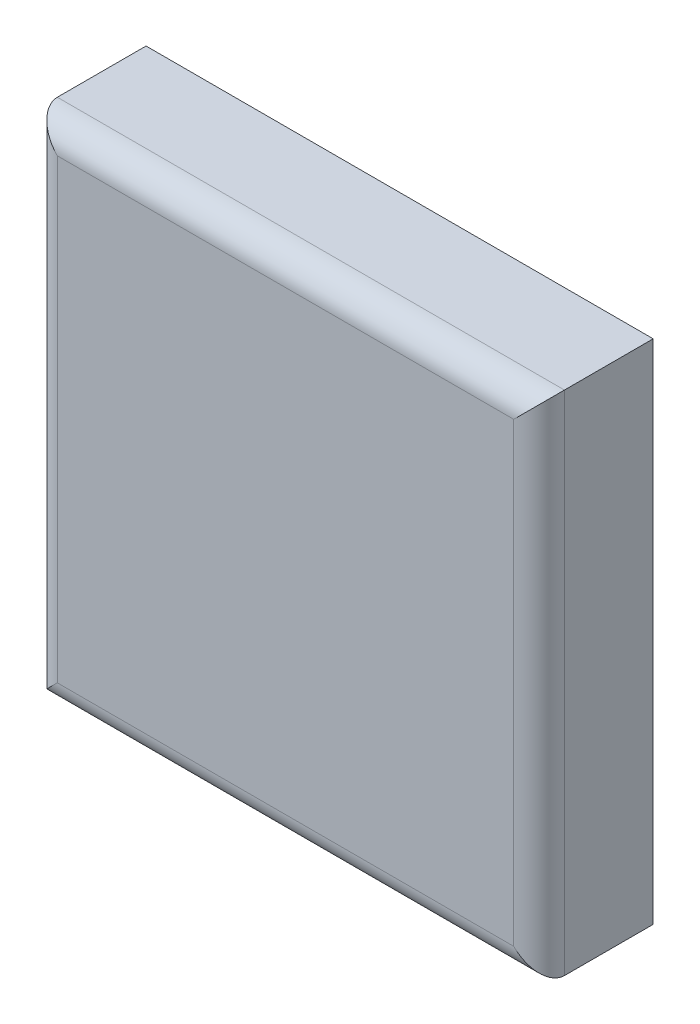
ISO-10303-21;
HEADER;
FILE_DESCRIPTION(('STEP AP214'),'2;1');
FILE_NAME('part.step','',(''),(''),'','','');
FILE_SCHEMA(('AUTOMOTIVE_DESIGN { 1 0 10303 214 1 1 1 1 }'));
ENDSEC;
DATA;
#1=APPLICATION_CONTEXT('core data for automotive mechanical design processes');
#2=APPLICATION_PROTOCOL_DEFINITION('international standard','automotive_design',2000,#1);
#3=PRODUCT_CONTEXT('',#1,'mechanical');
#4=PRODUCT('Part','Part','',(#3));
#5=PRODUCT_RELATED_PRODUCT_CATEGORY('part','',(#4));
#6=PRODUCT_DEFINITION_FORMATION('','',#4);
#7=PRODUCT_DEFINITION_CONTEXT('part definition',#1,'design');
#8=PRODUCT_DEFINITION('design','',#6,#7);
#9=PRODUCT_DEFINITION_SHAPE('','',#8);
#10=(LENGTH_UNIT() NAMED_UNIT(*) SI_UNIT(.MILLI.,.METRE.));
#11=(NAMED_UNIT(*) PLANE_ANGLE_UNIT() SI_UNIT($,.RADIAN.));
#12=(NAMED_UNIT(*) SI_UNIT($,.STERADIAN.) SOLID_ANGLE_UNIT());
#13=UNCERTAINTY_MEASURE_WITH_UNIT(LENGTH_MEASURE(1.E-05),#10,'distance_accuracy_value','');
#14=(GEOMETRIC_REPRESENTATION_CONTEXT(3) GLOBAL_UNCERTAINTY_ASSIGNED_CONTEXT((#13)) GLOBAL_UNIT_ASSIGNED_CONTEXT((#10,
#11,#12)) REPRESENTATION_CONTEXT('',''));
#15=CARTESIAN_POINT('',(0.,0.,0.));
#16=DIRECTION('',(0.,0.,1.));
#17=DIRECTION('',(1.,0.,0.));
#18=AXIS2_PLACEMENT_3D('',#15,#16,#17);
#19=CARTESIAN_POINT('',(100.,808.165252795848,-828.906828675602));
#20=DIRECTION('',(0.,-1.,0.));
#21=DIRECTION('',(0.,0.,-1.));
#22=AXIS2_PLACEMENT_3D('',#19,#20,#21);
#23=PLANE('',#22);
#24=DIRECTION('',(0.,0.,1.));
#25=VECTOR('',#24,1.);
#26=CARTESIAN_POINT('',(-100.,808.165252795848,-828.906828675602));
#27=LINE('',#26,#25);
#28=CARTESIAN_POINT('',(-100.,808.165252795848,-873.906828675602));
#29=VERTEX_POINT('',#28);
#30=CARTESIAN_POINT('',(-100.,808.165252795848,-838.906828675602));
#31=VERTEX_POINT('',#30);
#32=EDGE_CURVE('E116',#29,#31,#27,.T.);
#33=ORIENTED_EDGE('',*,*,#32,.T.);
#34=DIRECTION('',(-1.,0.,0.));
#35=VECTOR('',#34,1.);
#36=CARTESIAN_POINT('',(100.,808.165252795848,-838.906828675602));
#37=LINE('',#36,#35);
#38=CARTESIAN_POINT('',(100.,808.165252795848,-838.906828675602));
#39=VERTEX_POINT('',#38);
#40=EDGE_CURVE('E130',#31,#39,#37,.F.);
#41=ORIENTED_EDGE('',*,*,#40,.T.);
#42=DIRECTION('',(0.,0.,1.));
#43=VECTOR('',#42,1.);
#44=CARTESIAN_POINT('',(100.,808.165252795848,-828.906828675602));
#45=LINE('',#44,#43);
#46=CARTESIAN_POINT('',(100.,808.165252795848,-873.906828675602));
#47=VERTEX_POINT('',#46);
#48=EDGE_CURVE('E98',#47,#39,#45,.T.);
#49=ORIENTED_EDGE('',*,*,#48,.F.);
#50=DIRECTION('',(-1.,0.,0.));
#51=VECTOR('',#50,1.);
#52=CARTESIAN_POINT('',(100.,808.165252795848,-873.906828675602));
#53=LINE('',#52,#51);
#54=EDGE_CURVE('E107',#47,#29,#53,.T.);
#55=ORIENTED_EDGE('',*,*,#54,.T.);
#56=EDGE_LOOP('',(#33,#41,#49,#55));
#57=FACE_BOUND('',#56,.T.);
#58=ADVANCED_FACE('F41',(#57),#23,.F.);
#59=CARTESIAN_POINT('',(100.,808.165252795848,-828.906828675602));
#60=DIRECTION('',(0.,0.,-1.));
#61=DIRECTION('',(0.,1.,0.));
#62=AXIS2_PLACEMENT_3D('',#59,#60,#61);
#63=PLANE('',#62);
#64=DIRECTION('',(0.,-1.,0.));
#65=VECTOR('',#64,1.);
#66=CARTESIAN_POINT('',(90.,808.165252795848,-828.906828675602));
#67=LINE('',#66,#65);
#68=CARTESIAN_POINT('',(90.,618.165252795849,-828.906828675596));
#69=VERTEX_POINT('',#68);
#70=CARTESIAN_POINT('',(90.,798.165252795848,-828.906828675602));
#71=VERTEX_POINT('',#70);
#72=EDGE_CURVE('E125',#69,#71,#67,.F.);
#73=ORIENTED_EDGE('',*,*,#72,.T.);
#74=DIRECTION('',(-1.,0.,0.));
#75=VECTOR('',#74,1.);
#76=CARTESIAN_POINT('',(100.,798.165252795848,-828.906828675602));
#77=LINE('',#76,#75);
#78=CARTESIAN_POINT('',(-90.,798.165252795848,-828.906828675602));
#79=VERTEX_POINT('',#78);
#80=EDGE_CURVE('E127',#71,#79,#77,.T.);
#81=ORIENTED_EDGE('',*,*,#80,.T.);
#82=DIRECTION('',(0.,-1.,0.));
#83=VECTOR('',#82,1.);
#84=CARTESIAN_POINT('',(-90.,608.165252795848,-828.906828675596));
#85=LINE('',#84,#83);
#86=CARTESIAN_POINT('',(-90.,618.165252795849,-828.906828675596));
#87=VERTEX_POINT('',#86);
#88=EDGE_CURVE('E106',#79,#87,#85,.T.);
#89=ORIENTED_EDGE('',*,*,#88,.T.);
#90=DIRECTION('',(-1.,0.,0.));
#91=VECTOR('',#90,1.);
#92=CARTESIAN_POINT('',(100.,618.165252795849,-828.906828675596));
#93=LINE('',#92,#91);
#94=EDGE_CURVE('E123',#87,#69,#93,.F.);
#95=ORIENTED_EDGE('',*,*,#94,.T.);
#96=EDGE_LOOP('',(#73,#81,#89,#95));
#97=FACE_BOUND('',#96,.T.);
#98=ADVANCED_FACE('F163',(#97),#63,.F.);
#99=CARTESIAN_POINT('',(100.,608.165252795848,-828.906828675596));
#100=DIRECTION('',(0.,1.,0.));
#101=DIRECTION('',(0.,0.,1.));
#102=AXIS2_PLACEMENT_3D('',#99,#100,#101);
#103=PLANE('',#102);
#104=DIRECTION('',(0.,0.,-1.));
#105=VECTOR('',#104,1.);
#106=CARTESIAN_POINT('',(100.,608.165252795848,-828.906828675596));
#107=LINE('',#106,#105);
#108=CARTESIAN_POINT('',(100.,608.165252795848,-838.906828675596));
#109=VERTEX_POINT('',#108);
#110=CARTESIAN_POINT('',(100.,608.165252795848,-873.906828675602));
#111=VERTEX_POINT('',#110);
#112=EDGE_CURVE('E92',#109,#111,#107,.T.);
#113=ORIENTED_EDGE('',*,*,#112,.F.);
#114=DIRECTION('',(-1.,0.,0.));
#115=VECTOR('',#114,1.);
#116=CARTESIAN_POINT('',(100.,608.165252795848,-838.906828675596));
#117=LINE('',#116,#115);
#118=CARTESIAN_POINT('',(-100.,608.165252795848,-838.906828675596));
#119=VERTEX_POINT('',#118);
#120=EDGE_CURVE('E50',#109,#119,#117,.T.);
#121=ORIENTED_EDGE('',*,*,#120,.T.);
#122=DIRECTION('',(0.,0.,-1.));
#123=VECTOR('',#122,1.);
#124=CARTESIAN_POINT('',(-100.,608.165252795848,-828.906828675596));
#125=LINE('',#124,#123);
#126=CARTESIAN_POINT('',(-100.,608.165252795848,-873.906828675602));
#127=VERTEX_POINT('',#126);
#128=EDGE_CURVE('E103',#119,#127,#125,.T.);
#129=ORIENTED_EDGE('',*,*,#128,.T.);
#130=DIRECTION('',(-1.,0.,0.));
#131=VECTOR('',#130,1.);
#132=CARTESIAN_POINT('',(100.,608.165252795848,-873.906828675602));
#133=LINE('',#132,#131);
#134=EDGE_CURVE('E101',#111,#127,#133,.T.);
#135=ORIENTED_EDGE('',*,*,#134,.F.);
#136=EDGE_LOOP('',(#113,#121,#129,#135));
#137=FACE_BOUND('',#136,.T.);
#138=ADVANCED_FACE('F102',(#137),#103,.F.);
#139=CARTESIAN_POINT('',(100.,808.165252795848,-873.906828675602));
#140=DIRECTION('',(0.,0.,1.));
#141=DIRECTION('',(1.,0.,0.));
#142=AXIS2_PLACEMENT_3D('',#139,#140,#141);
#143=PLANE('',#142);
#144=DIRECTION('',(0.,1.,0.));
#145=VECTOR('',#144,1.);
#146=CARTESIAN_POINT('',(-100.,808.165252795848,-873.906828675602));
#147=LINE('',#146,#145);
#148=EDGE_CURVE('E120',#127,#29,#147,.T.);
#149=ORIENTED_EDGE('',*,*,#148,.T.);
#150=ORIENTED_EDGE('',*,*,#54,.F.);
#151=DIRECTION('',(0.,1.,0.));
#152=VECTOR('',#151,1.);
#153=CARTESIAN_POINT('',(100.,808.165252795848,-873.906828675602));
#154=LINE('',#153,#152);
#155=EDGE_CURVE('E96',#111,#47,#154,.T.);
#156=ORIENTED_EDGE('',*,*,#155,.F.);
#157=ORIENTED_EDGE('',*,*,#134,.T.);
#158=EDGE_LOOP('',(#149,#150,#156,#157));
#159=FACE_BOUND('',#158,.T.);
#160=ADVANCED_FACE('F109',(#159),#143,.F.);
#161=CARTESIAN_POINT('',(100.,0.,0.));
#162=DIRECTION('',(-1.,0.,0.));
#163=DIRECTION('',(0.,0.,1.));
#164=AXIS2_PLACEMENT_3D('',#161,#162,#163);
#165=PLANE('',#164);
#166=ORIENTED_EDGE('',*,*,#48,.T.);
#167=DIRECTION('',(0.,-1.,0.));
#168=VECTOR('',#167,1.);
#169=CARTESIAN_POINT('',(100.,-2.74755234629714E-11,-838.906828675576));
#170=LINE('',#169,#168);
#171=EDGE_CURVE('E65',#39,#109,#170,.T.);
#172=ORIENTED_EDGE('',*,*,#171,.T.);
#173=ORIENTED_EDGE('',*,*,#112,.T.);
#174=ORIENTED_EDGE('',*,*,#155,.T.);
#175=EDGE_LOOP('',(#166,#172,#173,#174));
#176=FACE_BOUND('',#175,.T.);
#177=ADVANCED_FACE('F94',(#176),#165,.F.);
#178=CARTESIAN_POINT('',(-100.,0.,0.));
#179=DIRECTION('',(-1.,0.,0.));
#180=DIRECTION('',(0.,0.,1.));
#181=AXIS2_PLACEMENT_3D('',#178,#179,#180);
#182=PLANE('',#181);
#183=ORIENTED_EDGE('',*,*,#128,.F.);
#184=DIRECTION('',(0.,-1.,0.));
#185=VECTOR('',#184,1.);
#186=CARTESIAN_POINT('',(-100.,808.165252795848,-838.906828675602));
#187=LINE('',#186,#185);
#188=EDGE_CURVE('E11',#119,#31,#187,.F.);
#189=ORIENTED_EDGE('',*,*,#188,.T.);
#190=ORIENTED_EDGE('',*,*,#32,.F.);
#191=ORIENTED_EDGE('',*,*,#148,.F.);
#192=EDGE_LOOP('',(#183,#189,#190,#191));
#193=FACE_BOUND('',#192,.T.);
#194=ADVANCED_FACE('F156',(#193),#182,.T.);
#195=CARTESIAN_POINT('',(100.,618.165252795848,-838.906828675596));
#196=DIRECTION('',(-1.,0.,0.));
#197=DIRECTION('',(0.,0.,1.));
#198=AXIS2_PLACEMENT_3D('',#195,#196,#197);
#199=CYLINDRICAL_SURFACE('',#198,10.);
#200=CARTESIAN_POINT('',(-90.,618.165252795848,-838.906828675596));
#201=DIRECTION('',(-0.707106781186547,0.707106781186547,0.));
#202=DIRECTION('',(0.707106781186547,0.707106781186547,0.));
#203=AXIS2_PLACEMENT_3D('',#200,#201,#202);
#204=ELLIPSE('',#203,14.1421356237309,10.);
#205=EDGE_CURVE('E138',#119,#87,#204,.T.);
#206=ORIENTED_EDGE('',*,*,#205,.F.);
#207=ORIENTED_EDGE('',*,*,#120,.F.);
#208=CARTESIAN_POINT('',(90.,618.165252795848,-838.906828675596));
#209=DIRECTION('',(-0.707106781186547,-0.707106781186547,0.));
#210=DIRECTION('',(-0.707106781186547,0.707106781186547,0.));
#211=AXIS2_PLACEMENT_3D('',#208,#209,#210);
#212=ELLIPSE('',#211,14.1421356237309,10.);
#213=EDGE_CURVE('E45',#69,#109,#212,.F.);
#214=ORIENTED_EDGE('',*,*,#213,.F.);
#215=ORIENTED_EDGE('',*,*,#94,.F.);
#216=EDGE_LOOP('',(#206,#207,#214,#215));
#217=FACE_BOUND('',#216,.T.);
#218=ADVANCED_FACE('F43',(#217),#199,.T.);
#219=CARTESIAN_POINT('',(90.,-2.74755234629714E-11,-838.906828675576));
#220=DIRECTION('',(0.,-1.,0.));
#221=DIRECTION('',(0.,0.,-1.));
#222=AXIS2_PLACEMENT_3D('',#219,#220,#221);
#223=CYLINDRICAL_SURFACE('',#222,10.);
#224=ORIENTED_EDGE('',*,*,#213,.T.);
#225=ORIENTED_EDGE('',*,*,#171,.F.);
#226=CARTESIAN_POINT('',(90.,798.165252795848,-838.906828675602));
#227=DIRECTION('',(0.707106781186547,-0.707106781186547,0.));
#228=DIRECTION('',(-0.707106781186547,-0.707106781186547,0.));
#229=AXIS2_PLACEMENT_3D('',#226,#227,#228);
#230=ELLIPSE('',#229,14.1421356237309,10.);
#231=EDGE_CURVE('E137',#71,#39,#230,.F.);
#232=ORIENTED_EDGE('',*,*,#231,.F.);
#233=ORIENTED_EDGE('',*,*,#72,.F.);
#234=EDGE_LOOP('',(#224,#225,#232,#233));
#235=FACE_BOUND('',#234,.T.);
#236=ADVANCED_FACE('F148',(#235),#223,.T.);
#237=CARTESIAN_POINT('',(-90.,808.165252795848,-838.906828675602));
#238=DIRECTION('',(0.,1.,0.));
#239=DIRECTION('',(0.,0.,1.));
#240=AXIS2_PLACEMENT_3D('',#237,#238,#239);
#241=CYLINDRICAL_SURFACE('',#240,10.);
#242=ORIENTED_EDGE('',*,*,#205,.T.);
#243=ORIENTED_EDGE('',*,*,#88,.F.);
#244=CARTESIAN_POINT('',(-90.,798.165252795848,-838.906828675602));
#245=DIRECTION('',(0.707106781186547,0.707106781186547,0.));
#246=DIRECTION('',(-0.707106781186547,0.707106781186547,0.));
#247=AXIS2_PLACEMENT_3D('',#244,#245,#246);
#248=ELLIPSE('',#247,14.1421356237309,10.);
#249=EDGE_CURVE('E135',#31,#79,#248,.T.);
#250=ORIENTED_EDGE('',*,*,#249,.F.);
#251=ORIENTED_EDGE('',*,*,#188,.F.);
#252=EDGE_LOOP('',(#242,#243,#250,#251));
#253=FACE_BOUND('',#252,.T.);
#254=ADVANCED_FACE('F153',(#253),#241,.T.);
#255=CARTESIAN_POINT('',(100.,798.165252795848,-838.906828675602));
#256=DIRECTION('',(-1.,0.,0.));
#257=DIRECTION('',(0.,0.,1.));
#258=AXIS2_PLACEMENT_3D('',#255,#256,#257);
#259=CYLINDRICAL_SURFACE('',#258,10.);
#260=ORIENTED_EDGE('',*,*,#231,.T.);
#261=ORIENTED_EDGE('',*,*,#40,.F.);
#262=ORIENTED_EDGE('',*,*,#249,.T.);
#263=ORIENTED_EDGE('',*,*,#80,.F.);
#264=EDGE_LOOP('',(#260,#261,#262,#263));
#265=FACE_BOUND('',#264,.T.);
#266=ADVANCED_FACE('F160',(#265),#259,.T.);
#267=CLOSED_SHELL('',(#58,#98,#138,#160,#177,#194,#218,#236,#254,#266));
#268=MANIFOLD_SOLID_BREP('B2',#267);
#269=ADVANCED_BREP_SHAPE_REPRESENTATION('',(#18,#268),#14);
#270=SHAPE_DEFINITION_REPRESENTATION(#9,#269);
ENDSEC;
END-ISO-10303-21;
